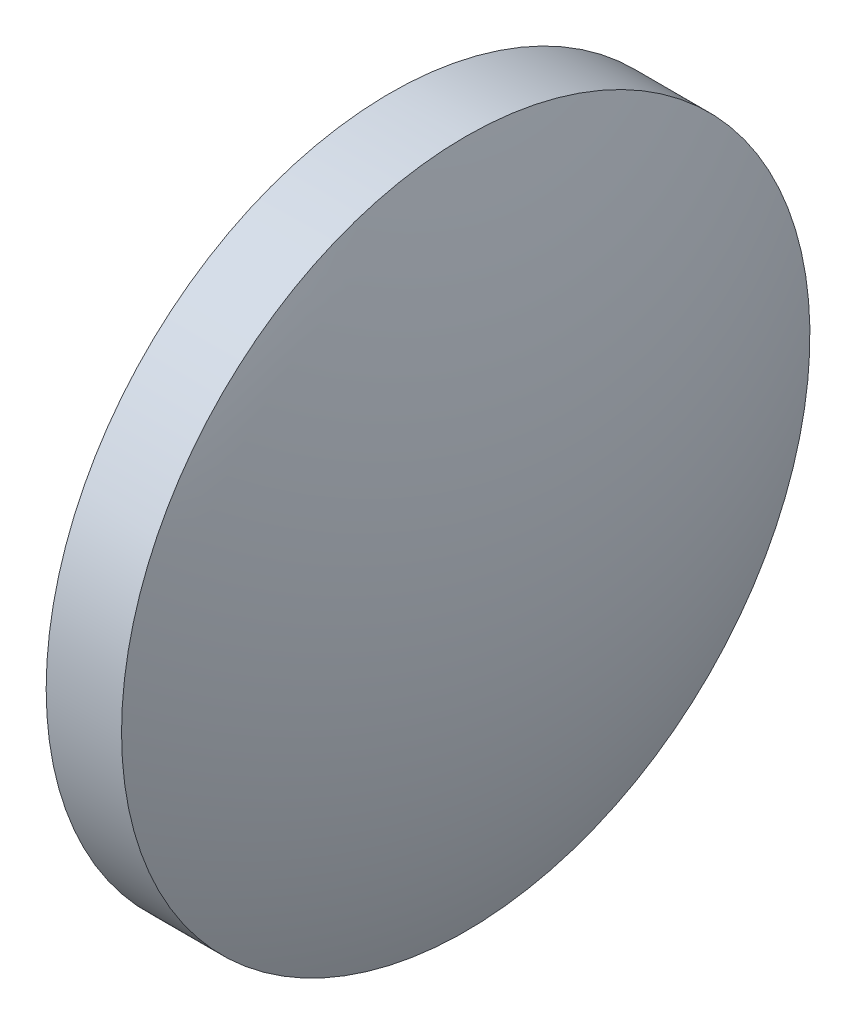
ISO-10303-21;
HEADER;
FILE_DESCRIPTION(('STEP AP214'),'2;1');
FILE_NAME('part.step','',(''),(''),'','','');
FILE_SCHEMA(('AUTOMOTIVE_DESIGN { 1 0 10303 214 1 1 1 1 }'));
ENDSEC;
DATA;
#1=APPLICATION_CONTEXT('core data for automotive mechanical design processes');
#2=APPLICATION_PROTOCOL_DEFINITION('international standard','automotive_design',2000,#1);
#3=PRODUCT_CONTEXT('',#1,'mechanical');
#4=PRODUCT('Part','Part','',(#3));
#5=PRODUCT_RELATED_PRODUCT_CATEGORY('part','',(#4));
#6=PRODUCT_DEFINITION_FORMATION('','',#4);
#7=PRODUCT_DEFINITION_CONTEXT('part definition',#1,'design');
#8=PRODUCT_DEFINITION('design','',#6,#7);
#9=PRODUCT_DEFINITION_SHAPE('','',#8);
#10=(LENGTH_UNIT() NAMED_UNIT(*) SI_UNIT(.MILLI.,.METRE.));
#11=(NAMED_UNIT(*) PLANE_ANGLE_UNIT() SI_UNIT($,.RADIAN.));
#12=(NAMED_UNIT(*) SI_UNIT($,.STERADIAN.) SOLID_ANGLE_UNIT());
#13=UNCERTAINTY_MEASURE_WITH_UNIT(LENGTH_MEASURE(1.E-05),#10,'distance_accuracy_value','');
#14=(GEOMETRIC_REPRESENTATION_CONTEXT(3) GLOBAL_UNCERTAINTY_ASSIGNED_CONTEXT((#13)) GLOBAL_UNIT_ASSIGNED_CONTEXT((#10,
#11,#12)) REPRESENTATION_CONTEXT('',''));
#15=CARTESIAN_POINT('',(0.,0.,0.));
#16=DIRECTION('',(0.,0.,1.));
#17=DIRECTION('',(1.,0.,0.));
#18=AXIS2_PLACEMENT_3D('',#15,#16,#17);
#19=CARTESIAN_POINT('',(533.71249921054,188.861205982599,0.));
#20=DIRECTION('',(-1.,0.,0.));
#21=DIRECTION('',(0.,1.,0.));
#22=AXIS2_PLACEMENT_3D('',#19,#20,#21);
#23=SPHERICAL_SURFACE('',#22,25.8806218905472);
#24=CARTESIAN_POINT('',(557.583121101088,188.861205982599,0.));
#25=DIRECTION('',(-1.,0.,0.));
#26=DIRECTION('',(0.,0.,1.));
#27=AXIS2_PLACEMENT_3D('',#24,#25,#26);
#28=CIRCLE('',#27,9.99999999999998);
#29=CARTESIAN_POINT('',(557.583121101088,188.861205982599,9.99999999999998));
#30=VERTEX_POINT('',#29);
#31=EDGE_CURVE('E10',#30,#30,#28,.T.);
#32=ORIENTED_EDGE('',*,*,#31,.F.);
#33=EDGE_LOOP('',(#32));
#34=FACE_BOUND('',#33,.T.);
#35=ADVANCED_FACE('F33',(#34),#23,.T.);
#36=CARTESIAN_POINT('',(550.736535325635,188.861205982599,0.));
#37=DIRECTION('',(-1.,0.,0.));
#38=DIRECTION('',(0.,0.,1.));
#39=AXIS2_PLACEMENT_3D('',#36,#37,#38);
#40=CYLINDRICAL_SURFACE('',#39,9.99999999999998);
#41=CARTESIAN_POINT('',(555.393121101088,188.861205982599,0.));
#42=DIRECTION('',(-1.,0.,0.));
#43=DIRECTION('',(0.,0.,1.));
#44=AXIS2_PLACEMENT_3D('',#41,#42,#43);
#45=CIRCLE('',#44,9.99999999999998);
#46=CARTESIAN_POINT('',(555.393121101088,188.861205982599,9.99999999999998));
#47=VERTEX_POINT('',#46);
#48=EDGE_CURVE('E39',#47,#47,#45,.T.);
#49=ORIENTED_EDGE('',*,*,#48,.F.);
#50=EDGE_LOOP('',(#49));
#51=FACE_BOUND('',#50,.T.);
#52=ORIENTED_EDGE('',*,*,#31,.T.);
#53=EDGE_LOOP('',(#52));
#54=FACE_BOUND('',#53,.T.);
#55=ADVANCED_FACE('F47',(#51,#54),#40,.T.);
#56=CARTESIAN_POINT('',(555.393121101088,188.861205982599,0.));
#57=DIRECTION('',(1.,0.,0.));
#58=DIRECTION('',(0.,0.,-1.));
#59=AXIS2_PLACEMENT_3D('',#56,#57,#58);
#60=PLANE('',#59);
#61=ORIENTED_EDGE('',*,*,#48,.T.);
#62=EDGE_LOOP('',(#61));
#63=FACE_BOUND('',#62,.T.);
#64=ADVANCED_FACE('F45',(#63),#60,.F.);
#65=CLOSED_SHELL('',(#35,#55,#64));
#66=MANIFOLD_SOLID_BREP('B2',#65);
#67=ADVANCED_BREP_SHAPE_REPRESENTATION('',(#18,#66),#14);
#68=SHAPE_DEFINITION_REPRESENTATION(#9,#67);
ENDSEC;
END-ISO-10303-21;
